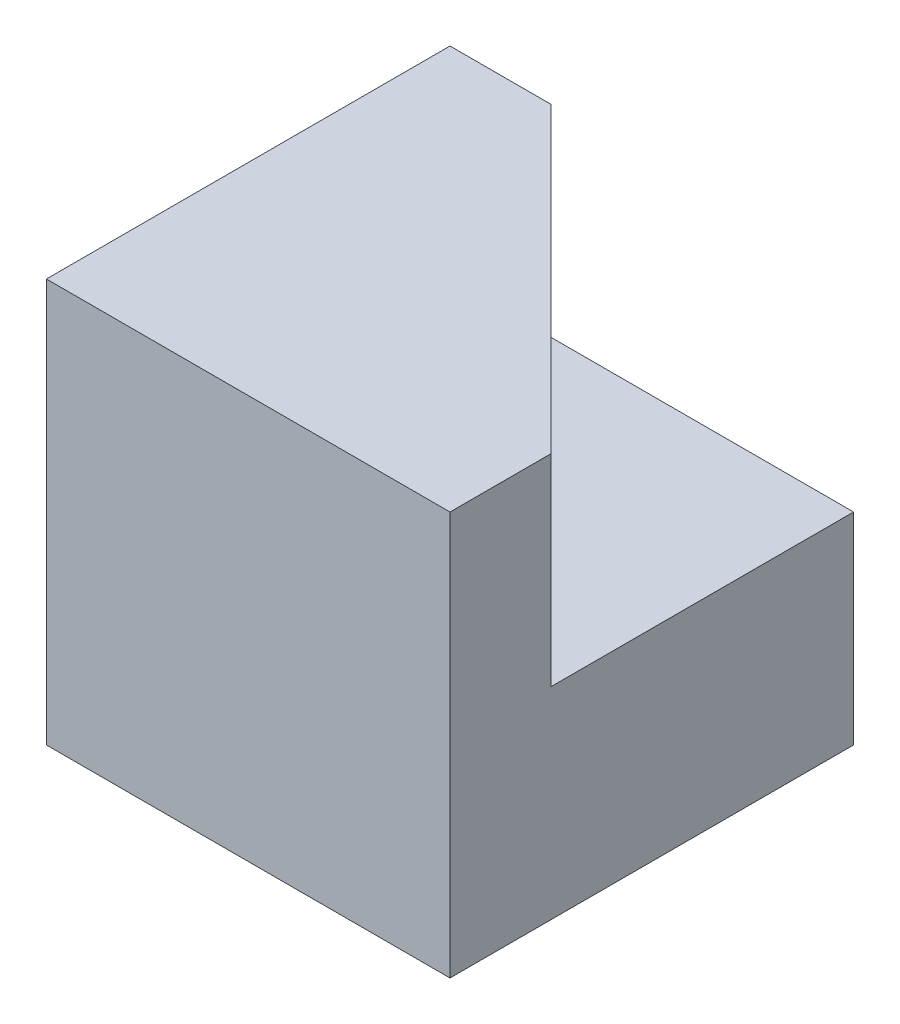
ISO-10303-21;
HEADER;
FILE_DESCRIPTION(('STEP AP214'),'2;1');
FILE_NAME('part.step','',(''),(''),'','','');
FILE_SCHEMA(('AUTOMOTIVE_DESIGN { 1 0 10303 214 1 1 1 1 }'));
ENDSEC;
DATA;
#1=APPLICATION_CONTEXT('core data for automotive mechanical design processes');
#2=APPLICATION_PROTOCOL_DEFINITION('international standard','automotive_design',2000,#1);
#3=PRODUCT_CONTEXT('',#1,'mechanical');
#4=PRODUCT('Part','Part','',(#3));
#5=PRODUCT_RELATED_PRODUCT_CATEGORY('part','',(#4));
#6=PRODUCT_DEFINITION_FORMATION('','',#4);
#7=PRODUCT_DEFINITION_CONTEXT('part definition',#1,'design');
#8=PRODUCT_DEFINITION('design','',#6,#7);
#9=PRODUCT_DEFINITION_SHAPE('','',#8);
#10=(LENGTH_UNIT() NAMED_UNIT(*) SI_UNIT(.MILLI.,.METRE.));
#11=(NAMED_UNIT(*) PLANE_ANGLE_UNIT() SI_UNIT($,.RADIAN.));
#12=(NAMED_UNIT(*) SI_UNIT($,.STERADIAN.) SOLID_ANGLE_UNIT());
#13=UNCERTAINTY_MEASURE_WITH_UNIT(LENGTH_MEASURE(1.E-05),#10,'distance_accuracy_value','');
#14=(GEOMETRIC_REPRESENTATION_CONTEXT(3) GLOBAL_UNCERTAINTY_ASSIGNED_CONTEXT((#13)) GLOBAL_UNIT_ASSIGNED_CONTEXT((#10,
#11,#12)) REPRESENTATION_CONTEXT('',''));
#15=CARTESIAN_POINT('',(0.,0.,0.));
#16=DIRECTION('',(0.,0.,1.));
#17=DIRECTION('',(1.,0.,0.));
#18=AXIS2_PLACEMENT_3D('',#15,#16,#17);
#19=CARTESIAN_POINT('',(0.,0.,40.));
#20=DIRECTION('',(1.,0.,0.));
#21=DIRECTION('',(0.,0.,-1.));
#22=AXIS2_PLACEMENT_3D('',#19,#20,#21);
#23=PLANE('',#22);
#24=DIRECTION('',(0.,-1.,0.));
#25=VECTOR('',#24,1.);
#26=CARTESIAN_POINT('',(0.,0.,0.));
#27=LINE('',#26,#25);
#28=CARTESIAN_POINT('',(0.,40.,0.));
#29=VERTEX_POINT('',#28);
#30=CARTESIAN_POINT('',(0.,0.,0.));
#31=VERTEX_POINT('',#30);
#32=EDGE_CURVE('E111',#29,#31,#27,.T.);
#33=ORIENTED_EDGE('',*,*,#32,.T.);
#34=DIRECTION('',(0.,0.,-1.));
#35=VECTOR('',#34,1.);
#36=CARTESIAN_POINT('',(0.,0.,40.));
#37=LINE('',#36,#35);
#38=CARTESIAN_POINT('',(0.,0.,40.));
#39=VERTEX_POINT('',#38);
#40=EDGE_CURVE('E11',#39,#31,#37,.T.);
#41=ORIENTED_EDGE('',*,*,#40,.F.);
#42=DIRECTION('',(0.,-1.,0.));
#43=VECTOR('',#42,1.);
#44=CARTESIAN_POINT('',(0.,0.,40.));
#45=LINE('',#44,#43);
#46=CARTESIAN_POINT('',(0.,40.,40.));
#47=VERTEX_POINT('',#46);
#48=EDGE_CURVE('E116',#47,#39,#45,.T.);
#49=ORIENTED_EDGE('',*,*,#48,.F.);
#50=DIRECTION('',(0.,0.,-1.));
#51=VECTOR('',#50,1.);
#52=CARTESIAN_POINT('',(0.,40.,40.));
#53=LINE('',#52,#51);
#54=EDGE_CURVE('E122',#47,#29,#53,.T.);
#55=ORIENTED_EDGE('',*,*,#54,.T.);
#56=EDGE_LOOP('',(#33,#41,#49,#55));
#57=FACE_BOUND('',#56,.T.);
#58=ADVANCED_FACE('F33',(#57),#23,.F.);
#59=CARTESIAN_POINT('',(0.,0.,40.));
#60=DIRECTION('',(0.,1.,0.));
#61=DIRECTION('',(0.,0.,1.));
#62=AXIS2_PLACEMENT_3D('',#59,#60,#61);
#63=PLANE('',#62);
#64=DIRECTION('',(1.,0.,0.));
#65=VECTOR('',#64,1.);
#66=CARTESIAN_POINT('',(0.,0.,0.));
#67=LINE('',#66,#65);
#68=CARTESIAN_POINT('',(40.,0.,0.));
#69=VERTEX_POINT('',#68);
#70=EDGE_CURVE('E125',#31,#69,#67,.T.);
#71=ORIENTED_EDGE('',*,*,#70,.T.);
#72=DIRECTION('',(0.,0.,-1.));
#73=VECTOR('',#72,1.);
#74=CARTESIAN_POINT('',(40.,0.,40.));
#75=LINE('',#74,#73);
#76=CARTESIAN_POINT('',(40.,0.,40.));
#77=VERTEX_POINT('',#76);
#78=EDGE_CURVE('E40',#77,#69,#75,.T.);
#79=ORIENTED_EDGE('',*,*,#78,.F.);
#80=DIRECTION('',(1.,0.,0.));
#81=VECTOR('',#80,1.);
#82=CARTESIAN_POINT('',(0.,0.,40.));
#83=LINE('',#82,#81);
#84=EDGE_CURVE('E81',#39,#77,#83,.T.);
#85=ORIENTED_EDGE('',*,*,#84,.F.);
#86=ORIENTED_EDGE('',*,*,#40,.T.);
#87=EDGE_LOOP('',(#71,#79,#85,#86));
#88=FACE_BOUND('',#87,.T.);
#89=ADVANCED_FACE('F139',(#88),#63,.F.);
#90=CARTESIAN_POINT('',(40.,0.,40.));
#91=DIRECTION('',(-1.,0.,0.));
#92=DIRECTION('',(0.,0.,1.));
#93=AXIS2_PLACEMENT_3D('',#90,#91,#92);
#94=PLANE('',#93);
#95=DIRECTION('',(0.,0.,-1.));
#96=VECTOR('',#95,1.);
#97=CARTESIAN_POINT('',(40.,20.,30.));
#98=LINE('',#97,#96);
#99=CARTESIAN_POINT('',(40.,20.,30.));
#100=VERTEX_POINT('',#99);
#101=CARTESIAN_POINT('',(40.,20.,0.));
#102=VERTEX_POINT('',#101);
#103=EDGE_CURVE('E47',#100,#102,#98,.T.);
#104=ORIENTED_EDGE('',*,*,#103,.F.);
#105=DIRECTION('',(0.,1.,0.));
#106=VECTOR('',#105,1.);
#107=CARTESIAN_POINT('',(40.,20.,30.));
#108=LINE('',#107,#106);
#109=CARTESIAN_POINT('',(40.,40.,30.));
#110=VERTEX_POINT('',#109);
#111=EDGE_CURVE('E99',#100,#110,#108,.T.);
#112=ORIENTED_EDGE('',*,*,#111,.T.);
#113=DIRECTION('',(0.,0.,-1.));
#114=VECTOR('',#113,1.);
#115=CARTESIAN_POINT('',(40.,40.,40.));
#116=LINE('',#115,#114);
#117=CARTESIAN_POINT('',(40.,40.,40.));
#118=VERTEX_POINT('',#117);
#119=EDGE_CURVE('E131',#118,#110,#116,.T.);
#120=ORIENTED_EDGE('',*,*,#119,.F.);
#121=DIRECTION('',(0.,1.,0.));
#122=VECTOR('',#121,1.);
#123=CARTESIAN_POINT('',(40.,0.,40.));
#124=LINE('',#123,#122);
#125=EDGE_CURVE('E119',#77,#118,#124,.T.);
#126=ORIENTED_EDGE('',*,*,#125,.F.);
#127=ORIENTED_EDGE('',*,*,#78,.T.);
#128=DIRECTION('',(0.,1.,0.));
#129=VECTOR('',#128,1.);
#130=CARTESIAN_POINT('',(40.,0.,0.));
#131=LINE('',#130,#129);
#132=EDGE_CURVE('E127',#69,#102,#131,.T.);
#133=ORIENTED_EDGE('',*,*,#132,.T.);
#134=EDGE_LOOP('',(#104,#112,#120,#126,#127,#133));
#135=FACE_BOUND('',#134,.T.);
#136=ADVANCED_FACE('F136',(#135),#94,.F.);
#137=CARTESIAN_POINT('',(0.,40.,40.));
#138=DIRECTION('',(0.,-1.,0.));
#139=DIRECTION('',(0.,0.,-1.));
#140=AXIS2_PLACEMENT_3D('',#137,#138,#139);
#141=PLANE('',#140);
#142=ORIENTED_EDGE('',*,*,#119,.T.);
#143=DIRECTION('',(0.707106781186547,0.,0.707106781186547));
#144=VECTOR('',#143,1.);
#145=CARTESIAN_POINT('',(10.,40.,0.));
#146=LINE('',#145,#144);
#147=CARTESIAN_POINT('',(10.,40.,0.));
#148=VERTEX_POINT('',#147);
#149=EDGE_CURVE('E106',#148,#110,#146,.T.);
#150=ORIENTED_EDGE('',*,*,#149,.F.);
#151=DIRECTION('',(-1.,0.,0.));
#152=VECTOR('',#151,1.);
#153=CARTESIAN_POINT('',(0.,40.,0.));
#154=LINE('',#153,#152);
#155=EDGE_CURVE('E74',#148,#29,#154,.T.);
#156=ORIENTED_EDGE('',*,*,#155,.T.);
#157=ORIENTED_EDGE('',*,*,#54,.F.);
#158=DIRECTION('',(-1.,0.,0.));
#159=VECTOR('',#158,1.);
#160=CARTESIAN_POINT('',(0.,40.,40.));
#161=LINE('',#160,#159);
#162=EDGE_CURVE('E56',#118,#47,#161,.T.);
#163=ORIENTED_EDGE('',*,*,#162,.F.);
#164=EDGE_LOOP('',(#142,#150,#156,#157,#163));
#165=FACE_BOUND('',#164,.T.);
#166=ADVANCED_FACE('F142',(#165),#141,.F.);
#167=CARTESIAN_POINT('',(0.,0.,40.));
#168=DIRECTION('',(0.,0.,-1.));
#169=DIRECTION('',(-1.,0.,0.));
#170=AXIS2_PLACEMENT_3D('',#167,#168,#169);
#171=PLANE('',#170);
#172=ORIENTED_EDGE('',*,*,#48,.T.);
#173=ORIENTED_EDGE('',*,*,#84,.T.);
#174=ORIENTED_EDGE('',*,*,#125,.T.);
#175=ORIENTED_EDGE('',*,*,#162,.T.);
#176=EDGE_LOOP('',(#172,#173,#174,#175));
#177=FACE_BOUND('',#176,.T.);
#178=ADVANCED_FACE('F144',(#177),#171,.F.);
#179=CARTESIAN_POINT('',(0.,0.,0.));
#180=DIRECTION('',(0.,0.,-1.));
#181=DIRECTION('',(-1.,0.,0.));
#182=AXIS2_PLACEMENT_3D('',#179,#180,#181);
#183=PLANE('',#182);
#184=DIRECTION('',(0.,1.,0.));
#185=VECTOR('',#184,1.);
#186=CARTESIAN_POINT('',(10.,20.,0.));
#187=LINE('',#186,#185);
#188=CARTESIAN_POINT('',(10.,20.,0.));
#189=VERTEX_POINT('',#188);
#190=EDGE_CURVE('E97',#189,#148,#187,.T.);
#191=ORIENTED_EDGE('',*,*,#190,.F.);
#192=DIRECTION('',(-1.,0.,0.));
#193=VECTOR('',#192,1.);
#194=CARTESIAN_POINT('',(40.,20.,0.));
#195=LINE('',#194,#193);
#196=EDGE_CURVE('E100',#102,#189,#195,.T.);
#197=ORIENTED_EDGE('',*,*,#196,.F.);
#198=ORIENTED_EDGE('',*,*,#132,.F.);
#199=ORIENTED_EDGE('',*,*,#70,.F.);
#200=ORIENTED_EDGE('',*,*,#32,.F.);
#201=ORIENTED_EDGE('',*,*,#155,.F.);
#202=EDGE_LOOP('',(#191,#197,#198,#199,#200,#201));
#203=FACE_BOUND('',#202,.T.);
#204=ADVANCED_FACE('F108',(#203),#183,.T.);
#205=CARTESIAN_POINT('',(10.,20.,0.));
#206=DIRECTION('',(-0.707106781186548,0.,0.707106781186548));
#207=DIRECTION('',(0.707106781186548,0.,0.707106781186548));
#208=AXIS2_PLACEMENT_3D('',#205,#206,#207);
#209=PLANE('',#208);
#210=ORIENTED_EDGE('',*,*,#149,.T.);
#211=ORIENTED_EDGE('',*,*,#111,.F.);
#212=DIRECTION('',(0.707106781186547,0.,0.707106781186547));
#213=VECTOR('',#212,1.);
#214=CARTESIAN_POINT('',(10.,20.,0.));
#215=LINE('',#214,#213);
#216=EDGE_CURVE('E94',#189,#100,#215,.T.);
#217=ORIENTED_EDGE('',*,*,#216,.F.);
#218=ORIENTED_EDGE('',*,*,#190,.T.);
#219=EDGE_LOOP('',(#210,#211,#217,#218));
#220=FACE_BOUND('',#219,.T.);
#221=ADVANCED_FACE('F95',(#220),#209,.F.);
#222=CARTESIAN_POINT('',(0.,20.,0.));
#223=DIRECTION('',(0.,-1.,0.));
#224=DIRECTION('',(0.,0.,-1.));
#225=AXIS2_PLACEMENT_3D('',#222,#223,#224);
#226=PLANE('',#225);
#227=ORIENTED_EDGE('',*,*,#196,.T.);
#228=ORIENTED_EDGE('',*,*,#216,.T.);
#229=ORIENTED_EDGE('',*,*,#103,.T.);
#230=EDGE_LOOP('',(#227,#228,#229));
#231=FACE_BOUND('',#230,.T.);
#232=ADVANCED_FACE('F102',(#231),#226,.F.);
#233=CLOSED_SHELL('',(#58,#89,#136,#166,#178,#204,#221,#232));
#234=MANIFOLD_SOLID_BREP('B2',#233);
#235=ADVANCED_BREP_SHAPE_REPRESENTATION('',(#18,#234),#14);
#236=SHAPE_DEFINITION_REPRESENTATION(#9,#235);
ENDSEC;
END-ISO-10303-21;
